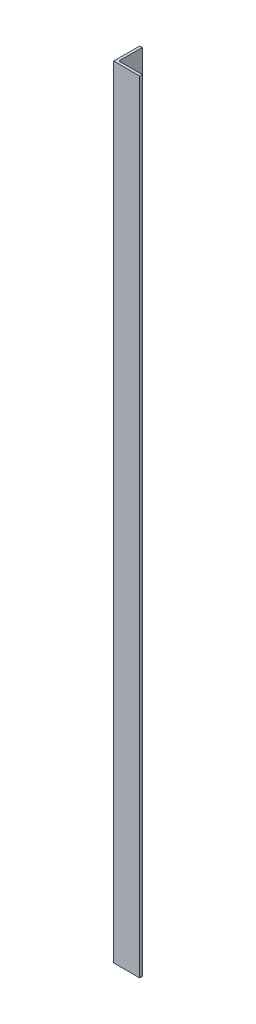
ISO-10303-21;
HEADER;
FILE_DESCRIPTION(('STEP AP214'),'2;1');
FILE_NAME('part.step','',(''),(''),'','','');
FILE_SCHEMA(('AUTOMOTIVE_DESIGN { 1 0 10303 214 1 1 1 1 }'));
ENDSEC;
DATA;
#1=APPLICATION_CONTEXT('core data for automotive mechanical design processes');
#2=APPLICATION_PROTOCOL_DEFINITION('international standard','automotive_design',2000,#1);
#3=PRODUCT_CONTEXT('',#1,'mechanical');
#4=PRODUCT('Part','Part','',(#3));
#5=PRODUCT_RELATED_PRODUCT_CATEGORY('part','',(#4));
#6=PRODUCT_DEFINITION_FORMATION('','',#4);
#7=PRODUCT_DEFINITION_CONTEXT('part definition',#1,'design');
#8=PRODUCT_DEFINITION('design','',#6,#7);
#9=PRODUCT_DEFINITION_SHAPE('','',#8);
#10=(LENGTH_UNIT() NAMED_UNIT(*) SI_UNIT(.MILLI.,.METRE.));
#11=(NAMED_UNIT(*) PLANE_ANGLE_UNIT() SI_UNIT($,.RADIAN.));
#12=(NAMED_UNIT(*) SI_UNIT($,.STERADIAN.) SOLID_ANGLE_UNIT());
#13=UNCERTAINTY_MEASURE_WITH_UNIT(LENGTH_MEASURE(1.E-05),#10,'distance_accuracy_value','');
#14=(GEOMETRIC_REPRESENTATION_CONTEXT(3) GLOBAL_UNCERTAINTY_ASSIGNED_CONTEXT((#13)) GLOBAL_UNIT_ASSIGNED_CONTEXT((#10,
#11,#12)) REPRESENTATION_CONTEXT('',''));
#15=CARTESIAN_POINT('',(0.,0.,0.));
#16=DIRECTION('',(0.,0.,1.));
#17=DIRECTION('',(1.,0.,0.));
#18=AXIS2_PLACEMENT_3D('',#15,#16,#17);
#19=CARTESIAN_POINT('',(0.,1500.,0.));
#20=DIRECTION('',(0.,0.,-1.));
#21=DIRECTION('',(-1.,0.,0.));
#22=AXIS2_PLACEMENT_3D('',#19,#20,#21);
#23=PLANE('',#22);
#24=DIRECTION('',(1.,0.,0.));
#25=VECTOR('',#24,1.);
#26=CARTESIAN_POINT('',(0.,0.,0.));
#27=LINE('',#26,#25);
#28=CARTESIAN_POINT('',(0.,0.,0.));
#29=VERTEX_POINT('',#28);
#30=CARTESIAN_POINT('',(50.,0.,0.));
#31=VERTEX_POINT('',#30);
#32=EDGE_CURVE('E116',#29,#31,#27,.T.);
#33=ORIENTED_EDGE('',*,*,#32,.T.);
#34=DIRECTION('',(0.,-1.,0.));
#35=VECTOR('',#34,1.);
#36=CARTESIAN_POINT('',(50.,1500.,0.));
#37=LINE('',#36,#35);
#38=CARTESIAN_POINT('',(50.,1500.,0.));
#39=VERTEX_POINT('',#38);
#40=EDGE_CURVE('E11',#39,#31,#37,.T.);
#41=ORIENTED_EDGE('',*,*,#40,.F.);
#42=DIRECTION('',(1.,0.,0.));
#43=VECTOR('',#42,1.);
#44=CARTESIAN_POINT('',(0.,1500.,0.));
#45=LINE('',#44,#43);
#46=CARTESIAN_POINT('',(0.,1500.,0.));
#47=VERTEX_POINT('',#46);
#48=EDGE_CURVE('E81',#47,#39,#45,.T.);
#49=ORIENTED_EDGE('',*,*,#48,.F.);
#50=DIRECTION('',(0.,-1.,0.));
#51=VECTOR('',#50,1.);
#52=CARTESIAN_POINT('',(0.,1500.,0.));
#53=LINE('',#52,#51);
#54=EDGE_CURVE('E112',#47,#29,#53,.T.);
#55=ORIENTED_EDGE('',*,*,#54,.T.);
#56=EDGE_LOOP('',(#33,#41,#49,#55));
#57=FACE_BOUND('',#56,.T.);
#58=ADVANCED_FACE('F35',(#57),#23,.F.);
#59=CARTESIAN_POINT('',(50.,1500.,-5.));
#60=DIRECTION('',(1.,0.,0.));
#61=DIRECTION('',(0.,0.,-1.));
#62=AXIS2_PLACEMENT_3D('',#59,#60,#61);
#63=PLANE('',#62);
#64=DIRECTION('',(0.,0.,1.));
#65=VECTOR('',#64,1.);
#66=CARTESIAN_POINT('',(50.,0.,-5.));
#67=LINE('',#66,#65);
#68=CARTESIAN_POINT('',(50.,0.,-5.));
#69=VERTEX_POINT('',#68);
#70=EDGE_CURVE('E119',#69,#31,#67,.T.);
#71=ORIENTED_EDGE('',*,*,#70,.F.);
#72=DIRECTION('',(0.,-1.,0.));
#73=VECTOR('',#72,1.);
#74=CARTESIAN_POINT('',(50.,1500.,-5.));
#75=LINE('',#74,#73);
#76=CARTESIAN_POINT('',(50.,1500.,-5.));
#77=VERTEX_POINT('',#76);
#78=EDGE_CURVE('E43',#77,#69,#75,.T.);
#79=ORIENTED_EDGE('',*,*,#78,.F.);
#80=DIRECTION('',(0.,0.,1.));
#81=VECTOR('',#80,1.);
#82=CARTESIAN_POINT('',(50.,1500.,-5.));
#83=LINE('',#82,#81);
#84=EDGE_CURVE('E205',#77,#39,#83,.T.);
#85=ORIENTED_EDGE('',*,*,#84,.T.);
#86=ORIENTED_EDGE('',*,*,#40,.T.);
#87=EDGE_LOOP('',(#71,#79,#85,#86));
#88=FACE_BOUND('',#87,.T.);
#89=ADVANCED_FACE('F137',(#88),#63,.T.);
#90=CARTESIAN_POINT('',(0.,1500.,-5.));
#91=DIRECTION('',(0.,0.,-1.));
#92=DIRECTION('',(-1.,0.,0.));
#93=AXIS2_PLACEMENT_3D('',#90,#91,#92);
#94=PLANE('',#93);
#95=DIRECTION('',(1.,0.,0.));
#96=VECTOR('',#95,1.);
#97=CARTESIAN_POINT('',(0.,0.,-5.));
#98=LINE('',#97,#96);
#99=CARTESIAN_POINT('',(5.,0.,-5.));
#100=VERTEX_POINT('',#99);
#101=EDGE_CURVE('E122',#100,#69,#98,.T.);
#102=ORIENTED_EDGE('',*,*,#101,.F.);
#103=DIRECTION('',(0.,-1.,0.));
#104=VECTOR('',#103,1.);
#105=CARTESIAN_POINT('',(5.,1500.,-5.));
#106=LINE('',#105,#104);
#107=CARTESIAN_POINT('',(5.,1500.,-5.));
#108=VERTEX_POINT('',#107);
#109=EDGE_CURVE('E102',#108,#100,#106,.T.);
#110=ORIENTED_EDGE('',*,*,#109,.F.);
#111=DIRECTION('',(1.,0.,0.));
#112=VECTOR('',#111,1.);
#113=CARTESIAN_POINT('',(0.,1500.,-5.));
#114=LINE('',#113,#112);
#115=EDGE_CURVE('E108',#108,#77,#114,.T.);
#116=ORIENTED_EDGE('',*,*,#115,.T.);
#117=ORIENTED_EDGE('',*,*,#78,.T.);
#118=EDGE_LOOP('',(#102,#110,#116,#117));
#119=FACE_BOUND('',#118,.T.);
#120=ADVANCED_FACE('F134',(#119),#94,.T.);
#121=CARTESIAN_POINT('',(5.,1500.,0.));
#122=DIRECTION('',(1.,0.,0.));
#123=DIRECTION('',(0.,0.,-1.));
#124=AXIS2_PLACEMENT_3D('',#121,#122,#123);
#125=PLANE('',#124);
#126=DIRECTION('',(0.,0.,-1.));
#127=VECTOR('',#126,1.);
#128=CARTESIAN_POINT('',(5.,0.,0.));
#129=LINE('',#128,#127);
#130=CARTESIAN_POINT('',(5.,0.,-50.));
#131=VERTEX_POINT('',#130);
#132=EDGE_CURVE('E97',#131,#100,#129,.F.);
#133=ORIENTED_EDGE('',*,*,#132,.F.);
#134=DIRECTION('',(0.,-1.,0.));
#135=VECTOR('',#134,1.);
#136=CARTESIAN_POINT('',(5.,1500.,-50.));
#137=LINE('',#136,#135);
#138=CARTESIAN_POINT('',(5.,1500.,-50.));
#139=VERTEX_POINT('',#138);
#140=EDGE_CURVE('E92',#139,#131,#137,.T.);
#141=ORIENTED_EDGE('',*,*,#140,.F.);
#142=DIRECTION('',(0.,0.,-1.));
#143=VECTOR('',#142,1.);
#144=CARTESIAN_POINT('',(5.,1500.,0.));
#145=LINE('',#144,#143);
#146=EDGE_CURVE('E95',#139,#108,#145,.F.);
#147=ORIENTED_EDGE('',*,*,#146,.T.);
#148=ORIENTED_EDGE('',*,*,#109,.T.);
#149=EDGE_LOOP('',(#133,#141,#147,#148));
#150=FACE_BOUND('',#149,.T.);
#151=ADVANCED_FACE('F94',(#150),#125,.T.);
#152=CARTESIAN_POINT('',(0.,1500.,-50.));
#153=DIRECTION('',(0.,0.,-1.));
#154=DIRECTION('',(-1.,0.,0.));
#155=AXIS2_PLACEMENT_3D('',#152,#153,#154);
#156=PLANE('',#155);
#157=DIRECTION('',(1.,0.,0.));
#158=VECTOR('',#157,1.);
#159=CARTESIAN_POINT('',(0.,0.,-50.));
#160=LINE('',#159,#158);
#161=CARTESIAN_POINT('',(0.,0.,-50.));
#162=VERTEX_POINT('',#161);
#163=EDGE_CURVE('E126',#162,#131,#160,.T.);
#164=ORIENTED_EDGE('',*,*,#163,.F.);
#165=DIRECTION('',(0.,-1.,0.));
#166=VECTOR('',#165,1.);
#167=CARTESIAN_POINT('',(0.,1500.,-50.));
#168=LINE('',#167,#166);
#169=CARTESIAN_POINT('',(0.,1500.,-50.));
#170=VERTEX_POINT('',#169);
#171=EDGE_CURVE('E72',#170,#162,#168,.T.);
#172=ORIENTED_EDGE('',*,*,#171,.F.);
#173=DIRECTION('',(1.,0.,0.));
#174=VECTOR('',#173,1.);
#175=CARTESIAN_POINT('',(0.,1500.,-50.));
#176=LINE('',#175,#174);
#177=EDGE_CURVE('E106',#170,#139,#176,.T.);
#178=ORIENTED_EDGE('',*,*,#177,.T.);
#179=ORIENTED_EDGE('',*,*,#140,.T.);
#180=EDGE_LOOP('',(#164,#172,#178,#179));
#181=FACE_BOUND('',#180,.T.);
#182=ADVANCED_FACE('F110',(#181),#156,.T.);
#183=CARTESIAN_POINT('',(0.,1500.,0.));
#184=DIRECTION('',(1.,0.,0.));
#185=DIRECTION('',(0.,0.,-1.));
#186=AXIS2_PLACEMENT_3D('',#183,#184,#185);
#187=PLANE('',#186);
#188=DIRECTION('',(0.,0.,1.));
#189=VECTOR('',#188,1.);
#190=CARTESIAN_POINT('',(0.,0.,0.));
#191=LINE('',#190,#189);
#192=EDGE_CURVE('E75',#162,#29,#191,.T.);
#193=ORIENTED_EDGE('',*,*,#192,.T.);
#194=ORIENTED_EDGE('',*,*,#54,.F.);
#195=DIRECTION('',(0.,0.,1.));
#196=VECTOR('',#195,1.);
#197=CARTESIAN_POINT('',(0.,1500.,0.));
#198=LINE('',#197,#196);
#199=EDGE_CURVE('E51',#170,#47,#198,.T.);
#200=ORIENTED_EDGE('',*,*,#199,.F.);
#201=ORIENTED_EDGE('',*,*,#171,.T.);
#202=EDGE_LOOP('',(#193,#194,#200,#201));
#203=FACE_BOUND('',#202,.T.);
#204=ADVANCED_FACE('F142',(#203),#187,.F.);
#205=CARTESIAN_POINT('',(0.,1500.,0.));
#206=DIRECTION('',(0.,-1.,0.));
#207=DIRECTION('',(-1.,0.,0.));
#208=AXIS2_PLACEMENT_3D('',#205,#206,#207);
#209=PLANE('',#208);
#210=ORIENTED_EDGE('',*,*,#48,.T.);
#211=ORIENTED_EDGE('',*,*,#84,.F.);
#212=ORIENTED_EDGE('',*,*,#115,.F.);
#213=ORIENTED_EDGE('',*,*,#146,.F.);
#214=ORIENTED_EDGE('',*,*,#177,.F.);
#215=ORIENTED_EDGE('',*,*,#199,.T.);
#216=EDGE_LOOP('',(#210,#211,#212,#213,#214,#215));
#217=FACE_BOUND('',#216,.T.);
#218=ADVANCED_FACE('F105',(#217),#209,.F.);
#219=CARTESIAN_POINT('',(0.,0.,0.));
#220=DIRECTION('',(0.,-1.,0.));
#221=DIRECTION('',(-1.,0.,0.));
#222=AXIS2_PLACEMENT_3D('',#219,#220,#221);
#223=PLANE('',#222);
#224=ORIENTED_EDGE('',*,*,#32,.F.);
#225=ORIENTED_EDGE('',*,*,#192,.F.);
#226=ORIENTED_EDGE('',*,*,#163,.T.);
#227=ORIENTED_EDGE('',*,*,#132,.T.);
#228=ORIENTED_EDGE('',*,*,#101,.T.);
#229=ORIENTED_EDGE('',*,*,#70,.T.);
#230=EDGE_LOOP('',(#224,#225,#226,#227,#228,#229));
#231=FACE_BOUND('',#230,.T.);
#232=ADVANCED_FACE('F140',(#231),#223,.T.);
#233=CLOSED_SHELL('',(#58,#89,#120,#151,#182,#204,#218,#232));
#234=MANIFOLD_SOLID_BREP('B2',#233);
#235=ADVANCED_BREP_SHAPE_REPRESENTATION('',(#18,#234),#14);
#236=SHAPE_DEFINITION_REPRESENTATION(#9,#235);
ENDSEC;
END-ISO-10303-21;
